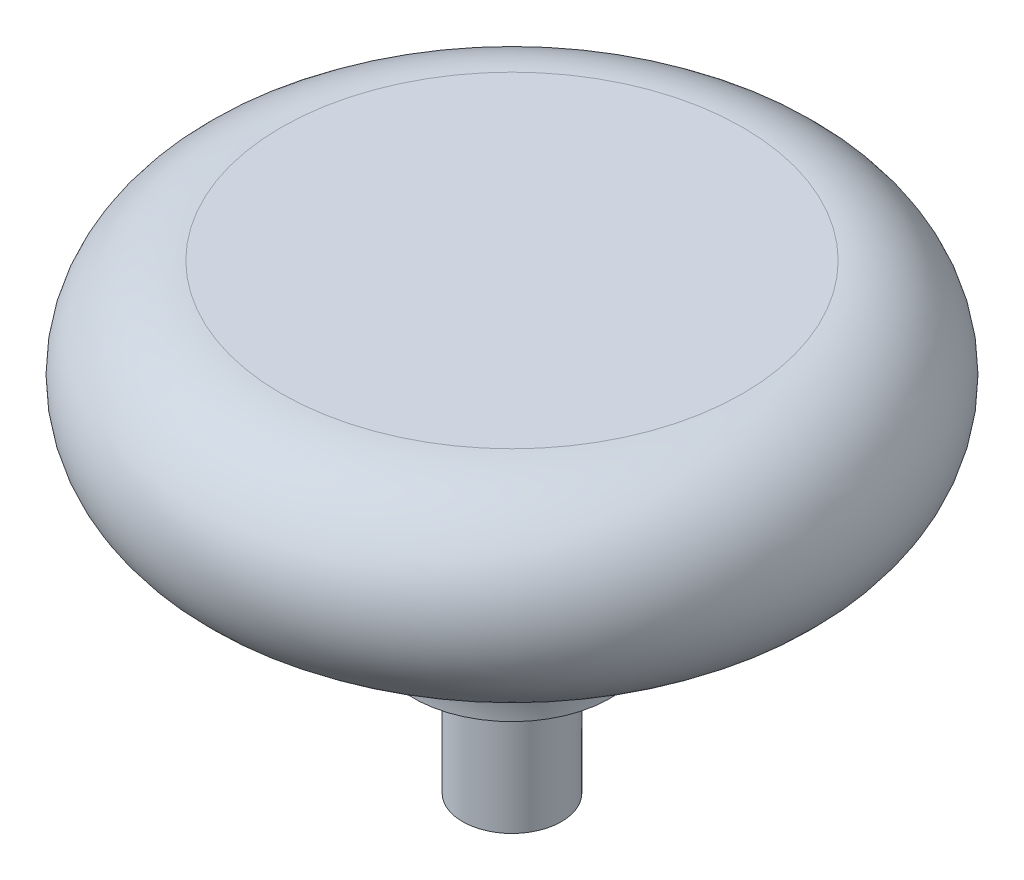
ISO-10303-21;
HEADER;
FILE_DESCRIPTION(('STEP AP214'),'2;1');
FILE_NAME('part.step','',(''),(''),'','','');
FILE_SCHEMA(('AUTOMOTIVE_DESIGN { 1 0 10303 214 1 1 1 1 }'));
ENDSEC;
DATA;
#1=APPLICATION_CONTEXT('core data for automotive mechanical design processes');
#2=APPLICATION_PROTOCOL_DEFINITION('international standard','automotive_design',2000,#1);
#3=PRODUCT_CONTEXT('',#1,'mechanical');
#4=PRODUCT('Part','Part','',(#3));
#5=PRODUCT_RELATED_PRODUCT_CATEGORY('part','',(#4));
#6=PRODUCT_DEFINITION_FORMATION('','',#4);
#7=PRODUCT_DEFINITION_CONTEXT('part definition',#1,'design');
#8=PRODUCT_DEFINITION('design','',#6,#7);
#9=PRODUCT_DEFINITION_SHAPE('','',#8);
#10=(LENGTH_UNIT() NAMED_UNIT(*) SI_UNIT(.MILLI.,.METRE.));
#11=(NAMED_UNIT(*) PLANE_ANGLE_UNIT() SI_UNIT($,.RADIAN.));
#12=(NAMED_UNIT(*) SI_UNIT($,.STERADIAN.) SOLID_ANGLE_UNIT());
#13=UNCERTAINTY_MEASURE_WITH_UNIT(LENGTH_MEASURE(1.E-05),#10,'distance_accuracy_value','');
#14=(GEOMETRIC_REPRESENTATION_CONTEXT(3) GLOBAL_UNCERTAINTY_ASSIGNED_CONTEXT((#13)) GLOBAL_UNIT_ASSIGNED_CONTEXT((#10,
#11,#12)) REPRESENTATION_CONTEXT('',''));
#15=CARTESIAN_POINT('',(0.,0.,0.));
#16=DIRECTION('',(0.,0.,1.));
#17=DIRECTION('',(1.,0.,0.));
#18=AXIS2_PLACEMENT_3D('',#15,#16,#17);
#19=CARTESIAN_POINT('',(2.38124999999995,0.,0.));
#20=DIRECTION('',(0.,1.,0.));
#21=DIRECTION('',(0.,0.,1.));
#22=AXIS2_PLACEMENT_3D('',#19,#20,#21);
#23=PLANE('',#22);
#24=CARTESIAN_POINT('',(0.,0.,0.));
#25=DIRECTION('',(0.,-1.,0.));
#26=DIRECTION('',(0.,0.,-1.));
#27=AXIS2_PLACEMENT_3D('',#24,#25,#26);
#28=CIRCLE('',#27,2.38125);
#29=CARTESIAN_POINT('',(0.,0.,-2.38125));
#30=VERTEX_POINT('',#29);
#31=EDGE_CURVE('E54',#30,#30,#28,.T.);
#32=ORIENTED_EDGE('',*,*,#31,.T.);
#33=EDGE_LOOP('',(#32));
#34=FACE_BOUND('',#33,.T.);
#35=ADVANCED_FACE('F35',(#34),#23,.F.);
#36=CARTESIAN_POINT('',(0.,22.225,0.));
#37=DIRECTION('',(0.,-1.,0.));
#38=DIRECTION('',(0.,0.,-1.));
#39=AXIS2_PLACEMENT_3D('',#36,#37,#38);
#40=PLANE('',#39);
#41=CARTESIAN_POINT('',(0.,22.225,0.));
#42=DIRECTION('',(0.,-1.,0.));
#43=DIRECTION('',(0.,0.,-1.));
#44=AXIS2_PLACEMENT_3D('',#41,#42,#43);
#45=CIRCLE('',#44,11.1125);
#46=CARTESIAN_POINT('',(0.,22.225,-11.1125));
#47=VERTEX_POINT('',#46);
#48=EDGE_CURVE('E10',#47,#47,#45,.T.);
#49=ORIENTED_EDGE('',*,*,#48,.F.);
#50=EDGE_LOOP('',(#49));
#51=FACE_BOUND('',#50,.T.);
#52=ADVANCED_FACE('F78',(#51),#40,.F.);
#53=CARTESIAN_POINT('',(0.,17.4625,0.));
#54=DIRECTION('',(0.,-1.,0.));
#55=DIRECTION('',(0.,0.,-1.));
#56=AXIS2_PLACEMENT_3D('',#53,#54,#55);
#57=TOROIDAL_SURFACE('',#56,11.1125,4.7625);
#58=CARTESIAN_POINT('',(0.,12.7,0.));
#59=DIRECTION('',(0.,-1.,0.));
#60=DIRECTION('',(0.,0.,-1.));
#61=AXIS2_PLACEMENT_3D('',#58,#59,#60);
#62=CIRCLE('',#61,11.1125);
#63=CARTESIAN_POINT('',(0.,12.7,-11.1125));
#64=VERTEX_POINT('',#63);
#65=EDGE_CURVE('E41',#64,#64,#62,.T.);
#66=ORIENTED_EDGE('',*,*,#65,.F.);
#67=EDGE_LOOP('',(#66));
#68=FACE_BOUND('',#67,.T.);
#69=ORIENTED_EDGE('',*,*,#48,.T.);
#70=EDGE_LOOP('',(#69));
#71=FACE_BOUND('',#70,.T.);
#72=ADVANCED_FACE('F73',(#68,#71),#57,.T.);
#73=CARTESIAN_POINT('',(0.,6.35000000000002,0.));
#74=DIRECTION('',(0.,-1.,0.));
#75=DIRECTION('',(0.,0.,-1.));
#76=AXIS2_PLACEMENT_3D('',#73,#74,#75);
#77=TOROIDAL_SURFACE('',#76,11.1125,6.35);
#78=CARTESIAN_POINT('',(0.,6.35000000000002,0.));
#79=DIRECTION('',(0.,-1.,0.));
#80=DIRECTION('',(0.,0.,-1.));
#81=AXIS2_PLACEMENT_3D('',#78,#79,#80);
#82=CIRCLE('',#81,4.7625);
#83=CARTESIAN_POINT('',(0.,6.35000000000002,-4.7625));
#84=VERTEX_POINT('',#83);
#85=EDGE_CURVE('E45',#84,#84,#82,.T.);
#86=ORIENTED_EDGE('',*,*,#85,.F.);
#87=EDGE_LOOP('',(#86));
#88=FACE_BOUND('',#87,.T.);
#89=ORIENTED_EDGE('',*,*,#65,.T.);
#90=EDGE_LOOP('',(#89));
#91=FACE_BOUND('',#90,.T.);
#92=ADVANCED_FACE('F68',(#88,#91),#77,.F.);
#93=CARTESIAN_POINT('',(4.7625,6.35000000000002,0.));
#94=DIRECTION('',(0.,1.,0.));
#95=DIRECTION('',(0.,0.,1.));
#96=AXIS2_PLACEMENT_3D('',#93,#94,#95);
#97=PLANE('',#96);
#98=CARTESIAN_POINT('',(0.,6.35000000000002,0.));
#99=DIRECTION('',(0.,-1.,0.));
#100=DIRECTION('',(0.,0.,-1.));
#101=AXIS2_PLACEMENT_3D('',#98,#99,#100);
#102=CIRCLE('',#101,2.38125);
#103=CARTESIAN_POINT('',(0.,6.35000000000002,-2.38125));
#104=VERTEX_POINT('',#103);
#105=EDGE_CURVE('E49',#104,#104,#102,.T.);
#106=ORIENTED_EDGE('',*,*,#105,.F.);
#107=EDGE_LOOP('',(#106));
#108=FACE_BOUND('',#107,.T.);
#109=ORIENTED_EDGE('',*,*,#85,.T.);
#110=EDGE_LOOP('',(#109));
#111=FACE_BOUND('',#110,.T.);
#112=ADVANCED_FACE('F62',(#108,#111),#97,.F.);
#113=CARTESIAN_POINT('',(0.,0.,0.));
#114=DIRECTION('',(0.,-1.,0.));
#115=DIRECTION('',(0.,0.,-1.));
#116=AXIS2_PLACEMENT_3D('',#113,#114,#115);
#117=CYLINDRICAL_SURFACE('',#116,2.38125);
#118=ORIENTED_EDGE('',*,*,#31,.F.);
#119=EDGE_LOOP('',(#118));
#120=FACE_BOUND('',#119,.T.);
#121=ORIENTED_EDGE('',*,*,#105,.T.);
#122=EDGE_LOOP('',(#121));
#123=FACE_BOUND('',#122,.T.);
#124=ADVANCED_FACE('F59',(#120,#123),#117,.T.);
#125=CLOSED_SHELL('',(#35,#52,#72,#92,#112,#124));
#126=MANIFOLD_SOLID_BREP('B2',#125);
#127=ADVANCED_BREP_SHAPE_REPRESENTATION('',(#18,#126),#14);
#128=SHAPE_DEFINITION_REPRESENTATION(#9,#127);
ENDSEC;
END-ISO-10303-21;
